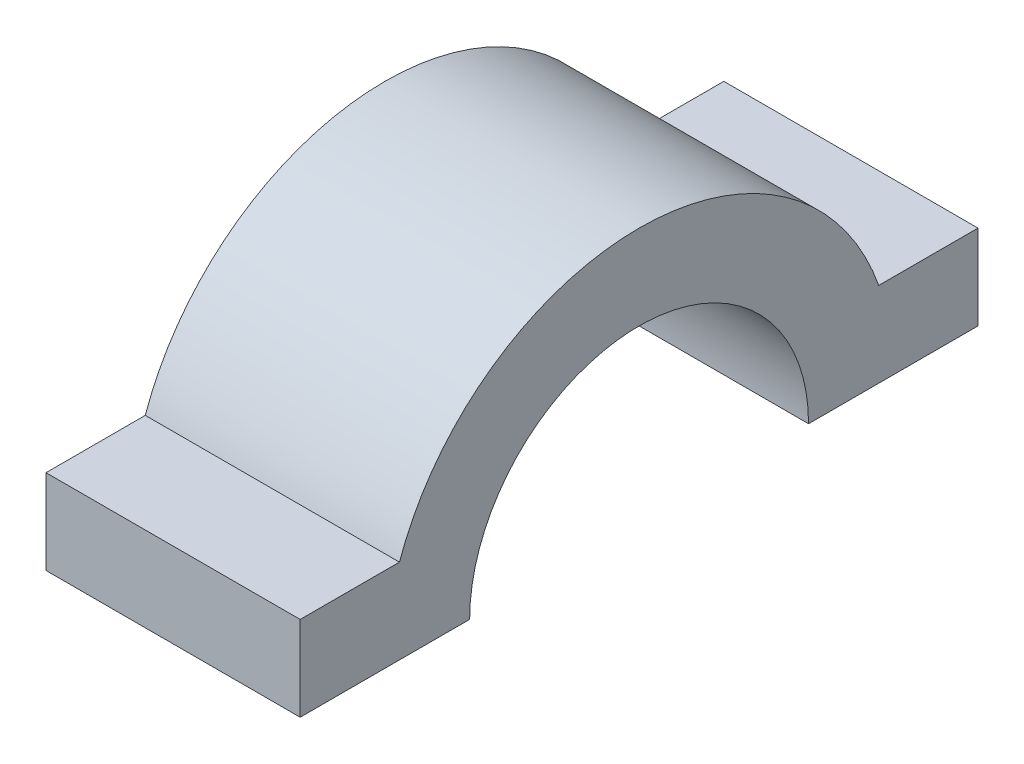
ISO-10303-21;
HEADER;
FILE_DESCRIPTION(('STEP AP214'),'2;1');
FILE_NAME('part.step','',(''),(''),'','','');
FILE_SCHEMA(('AUTOMOTIVE_DESIGN { 1 0 10303 214 1 1 1 1 }'));
ENDSEC;
DATA;
#1=APPLICATION_CONTEXT('core data for automotive mechanical design processes');
#2=APPLICATION_PROTOCOL_DEFINITION('international standard','automotive_design',2000,#1);
#3=PRODUCT_CONTEXT('',#1,'mechanical');
#4=PRODUCT('Part','Part','',(#3));
#5=PRODUCT_RELATED_PRODUCT_CATEGORY('part','',(#4));
#6=PRODUCT_DEFINITION_FORMATION('','',#4);
#7=PRODUCT_DEFINITION_CONTEXT('part definition',#1,'design');
#8=PRODUCT_DEFINITION('design','',#6,#7);
#9=PRODUCT_DEFINITION_SHAPE('','',#8);
#10=(LENGTH_UNIT() NAMED_UNIT(*) SI_UNIT(.MILLI.,.METRE.));
#11=(NAMED_UNIT(*) PLANE_ANGLE_UNIT() SI_UNIT($,.RADIAN.));
#12=(NAMED_UNIT(*) SI_UNIT($,.STERADIAN.) SOLID_ANGLE_UNIT());
#13=UNCERTAINTY_MEASURE_WITH_UNIT(LENGTH_MEASURE(1.E-05),#10,'distance_accuracy_value','');
#14=(GEOMETRIC_REPRESENTATION_CONTEXT(3) GLOBAL_UNCERTAINTY_ASSIGNED_CONTEXT((#13)) GLOBAL_UNIT_ASSIGNED_CONTEXT((#10,
#11,#12)) REPRESENTATION_CONTEXT('',''));
#15=CARTESIAN_POINT('',(0.,0.,0.));
#16=DIRECTION('',(0.,0.,1.));
#17=DIRECTION('',(1.,0.,0.));
#18=AXIS2_PLACEMENT_3D('',#15,#16,#17);
#19=CARTESIAN_POINT('',(15.,0.,0.));
#20=DIRECTION('',(-1.,0.,0.));
#21=DIRECTION('',(0.,0.,1.));
#22=AXIS2_PLACEMENT_3D('',#19,#20,#21);
#23=CYLINDRICAL_SURFACE('',#22,10.);
#24=CARTESIAN_POINT('',(0.,0.,0.));
#25=DIRECTION('',(-1.,0.,0.));
#26=DIRECTION('',(0.,0.,1.));
#27=AXIS2_PLACEMENT_3D('',#24,#25,#26);
#28=CIRCLE('',#27,10.);
#29=CARTESIAN_POINT('',(0.,0.,10.));
#30=VERTEX_POINT('',#29);
#31=CARTESIAN_POINT('',(0.,0.,-10.));
#32=VERTEX_POINT('',#31);
#33=EDGE_CURVE('E129',#30,#32,#28,.T.);
#34=ORIENTED_EDGE('',*,*,#33,.T.);
#35=DIRECTION('',(-1.,0.,0.));
#36=VECTOR('',#35,1.);
#37=CARTESIAN_POINT('',(15.,0.,-10.));
#38=LINE('',#37,#36);
#39=CARTESIAN_POINT('',(15.,0.,-10.));
#40=VERTEX_POINT('',#39);
#41=EDGE_CURVE('E11',#40,#32,#38,.T.);
#42=ORIENTED_EDGE('',*,*,#41,.F.);
#43=CARTESIAN_POINT('',(15.,0.,0.));
#44=DIRECTION('',(-1.,0.,0.));
#45=DIRECTION('',(0.,0.,1.));
#46=AXIS2_PLACEMENT_3D('',#43,#44,#45);
#47=CIRCLE('',#46,10.);
#48=CARTESIAN_POINT('',(15.,0.,10.));
#49=VERTEX_POINT('',#48);
#50=EDGE_CURVE('E143',#49,#40,#47,.T.);
#51=ORIENTED_EDGE('',*,*,#50,.F.);
#52=DIRECTION('',(-1.,0.,0.));
#53=VECTOR('',#52,1.);
#54=CARTESIAN_POINT('',(15.,0.,10.));
#55=LINE('',#54,#53);
#56=EDGE_CURVE('E125',#49,#30,#55,.T.);
#57=ORIENTED_EDGE('',*,*,#56,.T.);
#58=EDGE_LOOP('',(#34,#42,#51,#57));
#59=FACE_BOUND('',#58,.T.);
#60=ADVANCED_FACE('F33',(#59),#23,.F.);
#61=CARTESIAN_POINT('',(15.,0.,-20.));
#62=DIRECTION('',(0.,1.,0.));
#63=DIRECTION('',(0.,0.,1.));
#64=AXIS2_PLACEMENT_3D('',#61,#62,#63);
#65=PLANE('',#64);
#66=DIRECTION('',(0.,0.,-1.));
#67=VECTOR('',#66,1.);
#68=CARTESIAN_POINT('',(0.,0.,-20.));
#69=LINE('',#68,#67);
#70=CARTESIAN_POINT('',(0.,0.,-20.));
#71=VERTEX_POINT('',#70);
#72=EDGE_CURVE('E132',#32,#71,#69,.T.);
#73=ORIENTED_EDGE('',*,*,#72,.T.);
#74=DIRECTION('',(-1.,0.,0.));
#75=VECTOR('',#74,1.);
#76=CARTESIAN_POINT('',(15.,0.,-20.));
#77=LINE('',#76,#75);
#78=CARTESIAN_POINT('',(15.,0.,-20.));
#79=VERTEX_POINT('',#78);
#80=EDGE_CURVE('E41',#79,#71,#77,.T.);
#81=ORIENTED_EDGE('',*,*,#80,.F.);
#82=DIRECTION('',(0.,0.,-1.));
#83=VECTOR('',#82,1.);
#84=CARTESIAN_POINT('',(15.,0.,-20.));
#85=LINE('',#84,#83);
#86=EDGE_CURVE('E92',#40,#79,#85,.T.);
#87=ORIENTED_EDGE('',*,*,#86,.F.);
#88=ORIENTED_EDGE('',*,*,#41,.T.);
#89=EDGE_LOOP('',(#73,#81,#87,#88));
#90=FACE_BOUND('',#89,.T.);
#91=ADVANCED_FACE('F178',(#90),#65,.F.);
#92=CARTESIAN_POINT('',(15.,5.,-20.));
#93=DIRECTION('',(0.,0.,1.));
#94=DIRECTION('',(1.,0.,0.));
#95=AXIS2_PLACEMENT_3D('',#92,#93,#94);
#96=PLANE('',#95);
#97=DIRECTION('',(0.,1.,0.));
#98=VECTOR('',#97,1.);
#99=CARTESIAN_POINT('',(0.,5.,-20.));
#100=LINE('',#99,#98);
#101=CARTESIAN_POINT('',(0.,5.,-20.));
#102=VERTEX_POINT('',#101);
#103=EDGE_CURVE('E134',#71,#102,#100,.T.);
#104=ORIENTED_EDGE('',*,*,#103,.T.);
#105=DIRECTION('',(-1.,0.,0.));
#106=VECTOR('',#105,1.);
#107=CARTESIAN_POINT('',(15.,5.,-20.));
#108=LINE('',#107,#106);
#109=CARTESIAN_POINT('',(15.,5.,-20.));
#110=VERTEX_POINT('',#109);
#111=EDGE_CURVE('E150',#110,#102,#108,.T.);
#112=ORIENTED_EDGE('',*,*,#111,.F.);
#113=DIRECTION('',(0.,1.,0.));
#114=VECTOR('',#113,1.);
#115=CARTESIAN_POINT('',(15.,5.,-20.));
#116=LINE('',#115,#114);
#117=EDGE_CURVE('E158',#79,#110,#116,.T.);
#118=ORIENTED_EDGE('',*,*,#117,.F.);
#119=ORIENTED_EDGE('',*,*,#80,.T.);
#120=EDGE_LOOP('',(#104,#112,#118,#119));
#121=FACE_BOUND('',#120,.T.);
#122=ADVANCED_FACE('F156',(#121),#96,.F.);
#123=CARTESIAN_POINT('',(15.,5.,-14.142135623731));
#124=DIRECTION('',(0.,-1.,0.));
#125=DIRECTION('',(0.,0.,-1.));
#126=AXIS2_PLACEMENT_3D('',#123,#124,#125);
#127=PLANE('',#126);
#128=DIRECTION('',(0.,0.,1.));
#129=VECTOR('',#128,1.);
#130=CARTESIAN_POINT('',(0.,5.,-14.142135623731));
#131=LINE('',#130,#129);
#132=CARTESIAN_POINT('',(0.,5.,-14.142135623731));
#133=VERTEX_POINT('',#132);
#134=EDGE_CURVE('E136',#102,#133,#131,.T.);
#135=ORIENTED_EDGE('',*,*,#134,.T.);
#136=DIRECTION('',(-1.,0.,0.));
#137=VECTOR('',#136,1.);
#138=CARTESIAN_POINT('',(15.,5.,-14.142135623731));
#139=LINE('',#138,#137);
#140=CARTESIAN_POINT('',(15.,5.,-14.142135623731));
#141=VERTEX_POINT('',#140);
#142=EDGE_CURVE('E147',#141,#133,#139,.T.);
#143=ORIENTED_EDGE('',*,*,#142,.F.);
#144=DIRECTION('',(0.,0.,1.));
#145=VECTOR('',#144,1.);
#146=CARTESIAN_POINT('',(15.,5.,-14.142135623731));
#147=LINE('',#146,#145);
#148=EDGE_CURVE('E170',#110,#141,#147,.T.);
#149=ORIENTED_EDGE('',*,*,#148,.F.);
#150=ORIENTED_EDGE('',*,*,#111,.T.);
#151=EDGE_LOOP('',(#135,#143,#149,#150));
#152=FACE_BOUND('',#151,.T.);
#153=ADVANCED_FACE('F166',(#152),#127,.F.);
#154=CARTESIAN_POINT('',(15.,0.,0.));
#155=DIRECTION('',(-1.,0.,0.));
#156=DIRECTION('',(0.,0.,1.));
#157=AXIS2_PLACEMENT_3D('',#154,#155,#156);
#158=CYLINDRICAL_SURFACE('',#157,15.);
#159=CARTESIAN_POINT('',(0.,0.,0.));
#160=DIRECTION('',(1.,0.,0.));
#161=DIRECTION('',(0.,0.,1.));
#162=AXIS2_PLACEMENT_3D('',#159,#160,#161);
#163=CIRCLE('',#162,15.);
#164=CARTESIAN_POINT('',(0.,5.,14.142135623731));
#165=VERTEX_POINT('',#164);
#166=EDGE_CURVE('E138',#133,#165,#163,.T.);
#167=ORIENTED_EDGE('',*,*,#166,.T.);
#168=DIRECTION('',(-1.,0.,0.));
#169=VECTOR('',#168,1.);
#170=CARTESIAN_POINT('',(15.,5.,14.142135623731));
#171=LINE('',#170,#169);
#172=CARTESIAN_POINT('',(15.,5.,14.142135623731));
#173=VERTEX_POINT('',#172);
#174=EDGE_CURVE('E120',#173,#165,#171,.T.);
#175=ORIENTED_EDGE('',*,*,#174,.F.);
#176=CARTESIAN_POINT('',(15.,0.,0.));
#177=DIRECTION('',(1.,0.,0.));
#178=DIRECTION('',(0.,0.,1.));
#179=AXIS2_PLACEMENT_3D('',#176,#177,#178);
#180=CIRCLE('',#179,15.);
#181=EDGE_CURVE('E111',#141,#173,#180,.T.);
#182=ORIENTED_EDGE('',*,*,#181,.F.);
#183=ORIENTED_EDGE('',*,*,#142,.T.);
#184=EDGE_LOOP('',(#167,#175,#182,#183));
#185=FACE_BOUND('',#184,.T.);
#186=ADVANCED_FACE('F169',(#185),#158,.T.);
#187=CARTESIAN_POINT('',(15.,5.,20.));
#188=DIRECTION('',(0.,-1.,0.));
#189=DIRECTION('',(0.,0.,-1.));
#190=AXIS2_PLACEMENT_3D('',#187,#188,#189);
#191=PLANE('',#190);
#192=DIRECTION('',(0.,0.,1.));
#193=VECTOR('',#192,1.);
#194=CARTESIAN_POINT('',(0.,5.,20.));
#195=LINE('',#194,#193);
#196=CARTESIAN_POINT('',(0.,5.,20.));
#197=VERTEX_POINT('',#196);
#198=EDGE_CURVE('E119',#165,#197,#195,.T.);
#199=ORIENTED_EDGE('',*,*,#198,.T.);
#200=DIRECTION('',(-1.,0.,0.));
#201=VECTOR('',#200,1.);
#202=CARTESIAN_POINT('',(15.,5.,20.));
#203=LINE('',#202,#201);
#204=CARTESIAN_POINT('',(15.,5.,20.));
#205=VERTEX_POINT('',#204);
#206=EDGE_CURVE('E116',#205,#197,#203,.T.);
#207=ORIENTED_EDGE('',*,*,#206,.F.);
#208=DIRECTION('',(0.,0.,1.));
#209=VECTOR('',#208,1.);
#210=CARTESIAN_POINT('',(15.,5.,20.));
#211=LINE('',#210,#209);
#212=EDGE_CURVE('E105',#173,#205,#211,.T.);
#213=ORIENTED_EDGE('',*,*,#212,.F.);
#214=ORIENTED_EDGE('',*,*,#174,.T.);
#215=EDGE_LOOP('',(#199,#207,#213,#214));
#216=FACE_BOUND('',#215,.T.);
#217=ADVANCED_FACE('F117',(#216),#191,.F.);
#218=CARTESIAN_POINT('',(15.,0.,20.));
#219=DIRECTION('',(0.,0.,-1.));
#220=DIRECTION('',(-1.,0.,0.));
#221=AXIS2_PLACEMENT_3D('',#218,#219,#220);
#222=PLANE('',#221);
#223=DIRECTION('',(0.,-1.,0.));
#224=VECTOR('',#223,1.);
#225=CARTESIAN_POINT('',(0.,0.,20.));
#226=LINE('',#225,#224);
#227=CARTESIAN_POINT('',(0.,0.,20.));
#228=VERTEX_POINT('',#227);
#229=EDGE_CURVE('E78',#197,#228,#226,.T.);
#230=ORIENTED_EDGE('',*,*,#229,.T.);
#231=DIRECTION('',(-1.,0.,0.));
#232=VECTOR('',#231,1.);
#233=CARTESIAN_POINT('',(15.,0.,20.));
#234=LINE('',#233,#232);
#235=CARTESIAN_POINT('',(15.,0.,20.));
#236=VERTEX_POINT('',#235);
#237=EDGE_CURVE('E121',#236,#228,#234,.T.);
#238=ORIENTED_EDGE('',*,*,#237,.F.);
#239=DIRECTION('',(0.,-1.,0.));
#240=VECTOR('',#239,1.);
#241=CARTESIAN_POINT('',(15.,0.,20.));
#242=LINE('',#241,#240);
#243=EDGE_CURVE('E109',#205,#236,#242,.T.);
#244=ORIENTED_EDGE('',*,*,#243,.F.);
#245=ORIENTED_EDGE('',*,*,#206,.T.);
#246=EDGE_LOOP('',(#230,#238,#244,#245));
#247=FACE_BOUND('',#246,.T.);
#248=ADVANCED_FACE('F123',(#247),#222,.F.);
#249=CARTESIAN_POINT('',(15.,0.,10.));
#250=DIRECTION('',(0.,1.,0.));
#251=DIRECTION('',(0.,0.,1.));
#252=AXIS2_PLACEMENT_3D('',#249,#250,#251);
#253=PLANE('',#252);
#254=DIRECTION('',(0.,0.,-1.));
#255=VECTOR('',#254,1.);
#256=CARTESIAN_POINT('',(0.,0.,10.));
#257=LINE('',#256,#255);
#258=EDGE_CURVE('E84',#228,#30,#257,.T.);
#259=ORIENTED_EDGE('',*,*,#258,.T.);
#260=ORIENTED_EDGE('',*,*,#56,.F.);
#261=DIRECTION('',(0.,0.,-1.));
#262=VECTOR('',#261,1.);
#263=CARTESIAN_POINT('',(15.,0.,10.));
#264=LINE('',#263,#262);
#265=EDGE_CURVE('E49',#236,#49,#264,.T.);
#266=ORIENTED_EDGE('',*,*,#265,.F.);
#267=ORIENTED_EDGE('',*,*,#237,.T.);
#268=EDGE_LOOP('',(#259,#260,#266,#267));
#269=FACE_BOUND('',#268,.T.);
#270=ADVANCED_FACE('F194',(#269),#253,.F.);
#271=CARTESIAN_POINT('',(15.,0.,0.));
#272=DIRECTION('',(-1.,0.,0.));
#273=DIRECTION('',(0.,0.,1.));
#274=AXIS2_PLACEMENT_3D('',#271,#272,#273);
#275=PLANE('',#274);
#276=ORIENTED_EDGE('',*,*,#50,.T.);
#277=ORIENTED_EDGE('',*,*,#86,.T.);
#278=ORIENTED_EDGE('',*,*,#117,.T.);
#279=ORIENTED_EDGE('',*,*,#148,.T.);
#280=ORIENTED_EDGE('',*,*,#181,.T.);
#281=ORIENTED_EDGE('',*,*,#212,.T.);
#282=ORIENTED_EDGE('',*,*,#243,.T.);
#283=ORIENTED_EDGE('',*,*,#265,.T.);
#284=EDGE_LOOP('',(#276,#277,#278,#279,#280,#281,#282,#283));
#285=FACE_BOUND('',#284,.T.);
#286=ADVANCED_FACE('F107',(#285),#275,.F.);
#287=CARTESIAN_POINT('',(0.,0.,0.));
#288=DIRECTION('',(-1.,0.,0.));
#289=DIRECTION('',(0.,0.,1.));
#290=AXIS2_PLACEMENT_3D('',#287,#288,#289);
#291=PLANE('',#290);
#292=ORIENTED_EDGE('',*,*,#33,.F.);
#293=ORIENTED_EDGE('',*,*,#258,.F.);
#294=ORIENTED_EDGE('',*,*,#229,.F.);
#295=ORIENTED_EDGE('',*,*,#198,.F.);
#296=ORIENTED_EDGE('',*,*,#166,.F.);
#297=ORIENTED_EDGE('',*,*,#134,.F.);
#298=ORIENTED_EDGE('',*,*,#103,.F.);
#299=ORIENTED_EDGE('',*,*,#72,.F.);
#300=EDGE_LOOP('',(#292,#293,#294,#295,#296,#297,#298,#299));
#301=FACE_BOUND('',#300,.T.);
#302=ADVANCED_FACE('F162',(#301),#291,.T.);
#303=CLOSED_SHELL('',(#60,#91,#122,#153,#186,#217,#248,#270,#286,#302));
#304=MANIFOLD_SOLID_BREP('B2',#303);
#305=ADVANCED_BREP_SHAPE_REPRESENTATION('',(#18,#304),#14);
#306=SHAPE_DEFINITION_REPRESENTATION(#9,#305);
ENDSEC;
END-ISO-10303-21;
